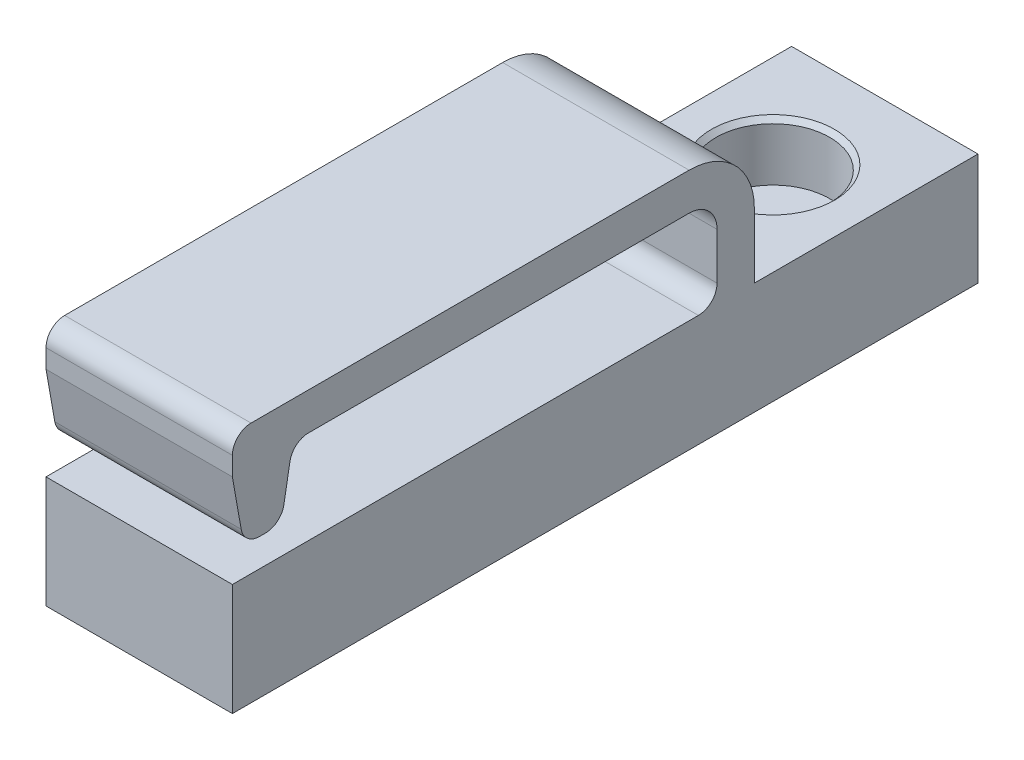
ISO-10303-21;
HEADER;
FILE_DESCRIPTION(('STEP AP214'),'2;1');
FILE_NAME('part.step','',(''),(''),'','','');
FILE_SCHEMA(('AUTOMOTIVE_DESIGN { 1 0 10303 214 1 1 1 1 }'));
ENDSEC;
DATA;
#1=APPLICATION_CONTEXT('core data for automotive mechanical design processes');
#2=APPLICATION_PROTOCOL_DEFINITION('international standard','automotive_design',2000,#1);
#3=PRODUCT_CONTEXT('',#1,'mechanical');
#4=PRODUCT('Part','Part','',(#3));
#5=PRODUCT_RELATED_PRODUCT_CATEGORY('part','',(#4));
#6=PRODUCT_DEFINITION_FORMATION('','',#4);
#7=PRODUCT_DEFINITION_CONTEXT('part definition',#1,'design');
#8=PRODUCT_DEFINITION('design','',#6,#7);
#9=PRODUCT_DEFINITION_SHAPE('','',#8);
#10=(LENGTH_UNIT() NAMED_UNIT(*) SI_UNIT(.MILLI.,.METRE.));
#11=(NAMED_UNIT(*) PLANE_ANGLE_UNIT() SI_UNIT($,.RADIAN.));
#12=(NAMED_UNIT(*) SI_UNIT($,.STERADIAN.) SOLID_ANGLE_UNIT());
#13=UNCERTAINTY_MEASURE_WITH_UNIT(LENGTH_MEASURE(1.E-05),#10,'distance_accuracy_value','');
#14=(GEOMETRIC_REPRESENTATION_CONTEXT(3) GLOBAL_UNCERTAINTY_ASSIGNED_CONTEXT((#13)) GLOBAL_UNIT_ASSIGNED_CONTEXT((#10,
#11,#12)) REPRESENTATION_CONTEXT('',''));
#15=CARTESIAN_POINT('',(0.,0.,0.));
#16=DIRECTION('',(0.,0.,1.));
#17=DIRECTION('',(1.,0.,0.));
#18=AXIS2_PLACEMENT_3D('',#15,#16,#17);
#19=CARTESIAN_POINT('',(0.,6.,0.));
#20=DIRECTION('',(0.,1.,0.));
#21=DIRECTION('',(0.,0.,1.));
#22=AXIS2_PLACEMENT_3D('',#19,#20,#21);
#23=PLANE('',#22);
#24=CARTESIAN_POINT('',(5.,6.,6.));
#25=DIRECTION('',(0.,1.,0.));
#26=DIRECTION('',(0.,0.,1.));
#27=AXIS2_PLACEMENT_3D('',#24,#25,#26);
#28=CIRCLE('',#27,3.30000000000001);
#29=CARTESIAN_POINT('',(5.,6.,9.30000000000001));
#30=VERTEX_POINT('',#29);
#31=EDGE_CURVE('E306',#30,#30,#28,.F.);
#32=ORIENTED_EDGE('',*,*,#31,.T.);
#33=EDGE_LOOP('',(#32));
#34=FACE_BOUND('',#33,.T.);
#35=DIRECTION('',(0.,0.,1.));
#36=VECTOR('',#35,1.);
#37=CARTESIAN_POINT('',(0.,6.,0.));
#38=LINE('',#37,#36);
#39=CARTESIAN_POINT('',(0.,6.,0.));
#40=VERTEX_POINT('',#39);
#41=CARTESIAN_POINT('',(0.,6.,12.));
#42=VERTEX_POINT('',#41);
#43=EDGE_CURVE('E258',#40,#42,#38,.T.);
#44=ORIENTED_EDGE('',*,*,#43,.T.);
#45=DIRECTION('',(1.,0.,0.));
#46=VECTOR('',#45,1.);
#47=CARTESIAN_POINT('',(0.,6.,12.));
#48=LINE('',#47,#46);
#49=CARTESIAN_POINT('',(10.,6.,12.));
#50=VERTEX_POINT('',#49);
#51=EDGE_CURVE('E208',#42,#50,#48,.T.);
#52=ORIENTED_EDGE('',*,*,#51,.T.);
#53=DIRECTION('',(0.,0.,-1.));
#54=VECTOR('',#53,1.);
#55=CARTESIAN_POINT('',(10.,6.,0.));
#56=LINE('',#55,#54);
#57=CARTESIAN_POINT('',(10.,6.,0.));
#58=VERTEX_POINT('',#57);
#59=EDGE_CURVE('E266',#50,#58,#56,.T.);
#60=ORIENTED_EDGE('',*,*,#59,.T.);
#61=DIRECTION('',(-1.,0.,0.));
#62=VECTOR('',#61,1.);
#63=CARTESIAN_POINT('',(0.,6.,0.));
#64=LINE('',#63,#62);
#65=EDGE_CURVE('E271',#58,#40,#64,.T.);
#66=ORIENTED_EDGE('',*,*,#65,.T.);
#67=EDGE_LOOP('',(#44,#52,#60,#66));
#68=FACE_BOUND('',#67,.T.);
#69=ADVANCED_FACE('F49',(#34,#68),#23,.T.);
#70=CARTESIAN_POINT('',(0.,6.,0.));
#71=DIRECTION('',(1.,0.,0.));
#72=DIRECTION('',(0.,0.,-1.));
#73=AXIS2_PLACEMENT_3D('',#70,#71,#72);
#74=PLANE('',#73);
#75=DIRECTION('',(0.,1.,0.));
#76=VECTOR('',#75,1.);
#77=CARTESIAN_POINT('',(0.,13.,40.));
#78=LINE('',#77,#76);
#79=CARTESIAN_POINT('',(0.,11.,40.));
#80=VERTEX_POINT('',#79);
#81=CARTESIAN_POINT('',(0.,12.,40.));
#82=VERTEX_POINT('',#81);
#83=EDGE_CURVE('E190',#80,#82,#78,.T.);
#84=ORIENTED_EDGE('',*,*,#83,.T.);
#85=CARTESIAN_POINT('',(0.,12.,39.));
#86=DIRECTION('',(1.,0.,0.));
#87=DIRECTION('',(0.,0.,-1.));
#88=AXIS2_PLACEMENT_3D('',#85,#86,#87);
#89=CIRCLE('',#88,1.);
#90=CARTESIAN_POINT('',(0.,13.,39.));
#91=VERTEX_POINT('',#90);
#92=EDGE_CURVE('E373',#82,#91,#89,.F.);
#93=ORIENTED_EDGE('',*,*,#92,.T.);
#94=DIRECTION('',(0.,0.,-1.));
#95=VECTOR('',#94,1.);
#96=CARTESIAN_POINT('',(0.,13.,12.));
#97=LINE('',#96,#95);
#98=CARTESIAN_POINT('',(0.,13.,15.5));
#99=VERTEX_POINT('',#98);
#100=EDGE_CURVE('E214',#91,#99,#97,.T.);
#101=ORIENTED_EDGE('',*,*,#100,.T.);
#102=CARTESIAN_POINT('',(0.,9.5,15.5));
#103=DIRECTION('',(1.,0.,0.));
#104=DIRECTION('',(0.,0.,-1.));
#105=AXIS2_PLACEMENT_3D('',#102,#103,#104);
#106=CIRCLE('',#105,3.5);
#107=CARTESIAN_POINT('',(0.,9.5,12.));
#108=VERTEX_POINT('',#107);
#109=EDGE_CURVE('E337',#99,#108,#106,.F.);
#110=ORIENTED_EDGE('',*,*,#109,.T.);
#111=DIRECTION('',(0.,-1.,0.));
#112=VECTOR('',#111,1.);
#113=CARTESIAN_POINT('',(0.,6.,12.));
#114=LINE('',#113,#112);
#115=EDGE_CURVE('E219',#108,#42,#114,.T.);
#116=ORIENTED_EDGE('',*,*,#115,.T.);
#117=ORIENTED_EDGE('',*,*,#43,.F.);
#118=DIRECTION('',(0.,-1.,0.));
#119=VECTOR('',#118,1.);
#120=CARTESIAN_POINT('',(0.,6.,0.));
#121=LINE('',#120,#119);
#122=CARTESIAN_POINT('',(0.,0.,0.));
#123=VERTEX_POINT('',#122);
#124=EDGE_CURVE('E274',#40,#123,#121,.T.);
#125=ORIENTED_EDGE('',*,*,#124,.T.);
#126=DIRECTION('',(0.,0.,1.));
#127=VECTOR('',#126,1.);
#128=CARTESIAN_POINT('',(0.,0.,0.));
#129=LINE('',#128,#127);
#130=CARTESIAN_POINT('',(0.,0.,40.));
#131=VERTEX_POINT('',#130);
#132=EDGE_CURVE('E257',#123,#131,#129,.T.);
#133=ORIENTED_EDGE('',*,*,#132,.T.);
#134=DIRECTION('',(0.,-1.,0.));
#135=VECTOR('',#134,1.);
#136=CARTESIAN_POINT('',(0.,6.,40.));
#137=LINE('',#136,#135);
#138=CARTESIAN_POINT('',(0.,6.,40.));
#139=VERTEX_POINT('',#138);
#140=EDGE_CURVE('E298',#139,#131,#137,.T.);
#141=ORIENTED_EDGE('',*,*,#140,.F.);
#142=CARTESIAN_POINT('',(0.,6.,15.));
#143=VERTEX_POINT('',#142);
#144=EDGE_CURVE('E263',#143,#139,#38,.T.);
#145=ORIENTED_EDGE('',*,*,#144,.F.);
#146=CARTESIAN_POINT('',(0.,7.,15.));
#147=DIRECTION('',(1.,0.,0.));
#148=DIRECTION('',(0.,0.,-1.));
#149=AXIS2_PLACEMENT_3D('',#146,#147,#148);
#150=CIRCLE('',#149,1.);
#151=CARTESIAN_POINT('',(0.,7.,14.));
#152=VERTEX_POINT('',#151);
#153=EDGE_CURVE('E350',#143,#152,#150,.T.);
#154=ORIENTED_EDGE('',*,*,#153,.T.);
#155=DIRECTION('',(0.,1.,0.));
#156=VECTOR('',#155,1.);
#157=CARTESIAN_POINT('',(0.,11.,14.));
#158=LINE('',#157,#156);
#159=CARTESIAN_POINT('',(0.,9.5,14.));
#160=VERTEX_POINT('',#159);
#161=EDGE_CURVE('E250',#152,#160,#158,.T.);
#162=ORIENTED_EDGE('',*,*,#161,.T.);
#163=CARTESIAN_POINT('',(0.,9.5,15.5));
#164=DIRECTION('',(1.,0.,0.));
#165=DIRECTION('',(0.,0.,-1.));
#166=AXIS2_PLACEMENT_3D('',#163,#164,#165);
#167=CIRCLE('',#166,1.5);
#168=CARTESIAN_POINT('',(0.,11.,15.5));
#169=VERTEX_POINT('',#168);
#170=EDGE_CURVE('E322',#160,#169,#167,.T.);
#171=ORIENTED_EDGE('',*,*,#170,.T.);
#172=DIRECTION('',(0.,0.,1.));
#173=VECTOR('',#172,1.);
#174=CARTESIAN_POINT('',(0.,11.,36.7657111350408));
#175=LINE('',#174,#173);
#176=CARTESIAN_POINT('',(0.,11.,35.9266115038635));
#177=VERTEX_POINT('',#176);
#178=EDGE_CURVE('E416',#169,#177,#175,.T.);
#179=ORIENTED_EDGE('',*,*,#178,.T.);
#180=CARTESIAN_POINT('',(0.,9.99999999999999,35.9266115038635));
#181=DIRECTION('',(1.,0.,0.));
#182=DIRECTION('',(0.,0.,-1.));
#183=AXIS2_PLACEMENT_3D('',#180,#181,#182);
#184=CIRCLE('',#183,1.);
#185=CARTESIAN_POINT('',(0.,10.1736481776669,36.9114192568757));
#186=VERTEX_POINT('',#185);
#187=EDGE_CURVE('E11',#177,#186,#184,.T.);
#188=ORIENTED_EDGE('',*,*,#187,.T.);
#189=DIRECTION('',(0.,-0.984807753012209,0.173648177666927));
#190=VECTOR('',#189,1.);
#191=CARTESIAN_POINT('',(0.,7.5,37.3828555675204));
#192=LINE('',#191,#190);
#193=CARTESIAN_POINT('',(0.,8.32635182233307,37.2371474456855));
#194=VERTEX_POINT('',#193);
#195=EDGE_CURVE('E414',#186,#194,#192,.T.);
#196=ORIENTED_EDGE('',*,*,#195,.T.);
#197=CARTESIAN_POINT('',(0.,8.5,38.2219551986977));
#198=DIRECTION('',(1.,0.,0.));
#199=DIRECTION('',(0.,0.,-1.));
#200=AXIS2_PLACEMENT_3D('',#197,#198,#199);
#201=CIRCLE('',#200,1.);
#202=CARTESIAN_POINT('',(0.,7.5,38.2219551986977));
#203=VERTEX_POINT('',#202);
#204=EDGE_CURVE('E370',#194,#203,#201,.F.);
#205=ORIENTED_EDGE('',*,*,#204,.T.);
#206=DIRECTION('',(0.,0.,1.));
#207=VECTOR('',#206,1.);
#208=CARTESIAN_POINT('',(0.,7.5,39.3828555675204));
#209=LINE('',#208,#207);
#210=CARTESIAN_POINT('',(0.,7.5,38.5437559363431));
#211=VERTEX_POINT('',#210);
#212=EDGE_CURVE('E196',#203,#211,#209,.T.);
#213=ORIENTED_EDGE('',*,*,#212,.T.);
#214=CARTESIAN_POINT('',(0.,8.5,38.5437559363431));
#215=DIRECTION('',(1.,0.,0.));
#216=DIRECTION('',(0.,0.,-1.));
#217=AXIS2_PLACEMENT_3D('',#214,#215,#216);
#218=CIRCLE('',#217,1.);
#219=CARTESIAN_POINT('',(0.,8.32635182233307,39.5285636893553));
#220=VERTEX_POINT('',#219);
#221=EDGE_CURVE('E65',#211,#220,#218,.F.);
#222=ORIENTED_EDGE('',*,*,#221,.T.);
#223=DIRECTION('',(0.,0.984807753012209,0.173648177666927));
#224=VECTOR('',#223,1.);
#225=CARTESIAN_POINT('',(0.,11.,40.));
#226=LINE('',#225,#224);
#227=EDGE_CURVE('E186',#220,#80,#226,.T.);
#228=ORIENTED_EDGE('',*,*,#227,.T.);
#229=EDGE_LOOP('',(#84,#93,#101,#110,#116,#117,#125,#133,#141,#145,#154,#162,#171,#179,#188,
#196,#205,#213,#222,#228));
#230=FACE_BOUND('',#229,.T.);
#231=ADVANCED_FACE('F188',(#230),#74,.F.);
#232=CARTESIAN_POINT('',(0.,6.,40.));
#233=DIRECTION('',(0.,0.,-1.));
#234=DIRECTION('',(-1.,0.,0.));
#235=AXIS2_PLACEMENT_3D('',#232,#233,#234);
#236=PLANE('',#235);
#237=DIRECTION('',(1.,0.,0.));
#238=VECTOR('',#237,1.);
#239=CARTESIAN_POINT('',(0.,0.,40.));
#240=LINE('',#239,#238);
#241=CARTESIAN_POINT('',(10.,0.,40.));
#242=VERTEX_POINT('',#241);
#243=EDGE_CURVE('E278',#131,#242,#240,.T.);
#244=ORIENTED_EDGE('',*,*,#243,.T.);
#245=DIRECTION('',(0.,-1.,0.));
#246=VECTOR('',#245,1.);
#247=CARTESIAN_POINT('',(10.,6.,40.));
#248=LINE('',#247,#246);
#249=CARTESIAN_POINT('',(10.,6.,40.));
#250=VERTEX_POINT('',#249);
#251=EDGE_CURVE('E294',#250,#242,#248,.T.);
#252=ORIENTED_EDGE('',*,*,#251,.F.);
#253=DIRECTION('',(1.,0.,0.));
#254=VECTOR('',#253,1.);
#255=CARTESIAN_POINT('',(0.,6.,40.));
#256=LINE('',#255,#254);
#257=EDGE_CURVE('E262',#139,#250,#256,.T.);
#258=ORIENTED_EDGE('',*,*,#257,.F.);
#259=ORIENTED_EDGE('',*,*,#140,.T.);
#260=EDGE_LOOP('',(#244,#252,#258,#259));
#261=FACE_BOUND('',#260,.T.);
#262=ADVANCED_FACE('F466',(#261),#236,.F.);
#263=CARTESIAN_POINT('',(10.,6.,0.));
#264=DIRECTION('',(-1.,0.,0.));
#265=DIRECTION('',(0.,0.,1.));
#266=AXIS2_PLACEMENT_3D('',#263,#264,#265);
#267=PLANE('',#266);
#268=DIRECTION('',(0.,0.,-1.));
#269=VECTOR('',#268,1.);
#270=CARTESIAN_POINT('',(10.,13.,12.));
#271=LINE('',#270,#269);
#272=CARTESIAN_POINT('',(10.,13.,39.));
#273=VERTEX_POINT('',#272);
#274=CARTESIAN_POINT('',(10.,13.,15.5));
#275=VERTEX_POINT('',#274);
#276=EDGE_CURVE('E244',#273,#275,#271,.T.);
#277=ORIENTED_EDGE('',*,*,#276,.F.);
#278=CARTESIAN_POINT('',(10.,12.,39.));
#279=DIRECTION('',(-1.,0.,0.));
#280=DIRECTION('',(0.,0.,1.));
#281=AXIS2_PLACEMENT_3D('',#278,#279,#280);
#282=CIRCLE('',#281,1.);
#283=CARTESIAN_POINT('',(10.,12.,40.));
#284=VERTEX_POINT('',#283);
#285=EDGE_CURVE('E363',#273,#284,#282,.F.);
#286=ORIENTED_EDGE('',*,*,#285,.T.);
#287=DIRECTION('',(0.,1.,0.));
#288=VECTOR('',#287,1.);
#289=CARTESIAN_POINT('',(10.,13.,40.));
#290=LINE('',#289,#288);
#291=CARTESIAN_POINT('',(10.,11.,40.));
#292=VERTEX_POINT('',#291);
#293=EDGE_CURVE('E241',#292,#284,#290,.T.);
#294=ORIENTED_EDGE('',*,*,#293,.F.);
#295=DIRECTION('',(0.,0.984807753012209,0.173648177666927));
#296=VECTOR('',#295,1.);
#297=CARTESIAN_POINT('',(10.,11.,40.));
#298=LINE('',#297,#296);
#299=CARTESIAN_POINT('',(10.,8.32635182233307,39.5285636893553));
#300=VERTEX_POINT('',#299);
#301=EDGE_CURVE('E202',#300,#292,#298,.T.);
#302=ORIENTED_EDGE('',*,*,#301,.F.);
#303=CARTESIAN_POINT('',(10.,8.5,38.5437559363431));
#304=DIRECTION('',(-1.,0.,0.));
#305=DIRECTION('',(0.,0.,1.));
#306=AXIS2_PLACEMENT_3D('',#303,#304,#305);
#307=CIRCLE('',#306,1.);
#308=CARTESIAN_POINT('',(10.,7.5,38.5437559363431));
#309=VERTEX_POINT('',#308);
#310=EDGE_CURVE('E357',#300,#309,#307,.F.);
#311=ORIENTED_EDGE('',*,*,#310,.T.);
#312=DIRECTION('',(0.,0.,1.));
#313=VECTOR('',#312,1.);
#314=CARTESIAN_POINT('',(10.,7.5,39.3828555675204));
#315=LINE('',#314,#313);
#316=CARTESIAN_POINT('',(10.,7.5,38.2219551986977));
#317=VERTEX_POINT('',#316);
#318=EDGE_CURVE('E236',#317,#309,#315,.T.);
#319=ORIENTED_EDGE('',*,*,#318,.F.);
#320=CARTESIAN_POINT('',(10.,8.5,38.2219551986977));
#321=DIRECTION('',(-1.,0.,0.));
#322=DIRECTION('',(0.,0.,1.));
#323=AXIS2_PLACEMENT_3D('',#320,#321,#322);
#324=CIRCLE('',#323,1.);
#325=CARTESIAN_POINT('',(10.,8.32635182233307,37.2371474456855));
#326=VERTEX_POINT('',#325);
#327=EDGE_CURVE('E360',#317,#326,#324,.F.);
#328=ORIENTED_EDGE('',*,*,#327,.T.);
#329=DIRECTION('',(0.,-0.984807753012209,0.173648177666927));
#330=VECTOR('',#329,1.);
#331=CARTESIAN_POINT('',(10.,7.5,37.3828555675204));
#332=LINE('',#331,#330);
#333=CARTESIAN_POINT('',(10.,10.1736481776669,36.9114192568757));
#334=VERTEX_POINT('',#333);
#335=EDGE_CURVE('E232',#334,#326,#332,.T.);
#336=ORIENTED_EDGE('',*,*,#335,.F.);
#337=CARTESIAN_POINT('',(10.,9.99999999999999,35.9266115038635));
#338=DIRECTION('',(-1.,0.,0.));
#339=DIRECTION('',(0.,0.,1.));
#340=AXIS2_PLACEMENT_3D('',#337,#338,#339);
#341=CIRCLE('',#340,1.);
#342=CARTESIAN_POINT('',(10.,11.,35.9266115038635));
#343=VERTEX_POINT('',#342);
#344=EDGE_CURVE('E58',#334,#343,#341,.T.);
#345=ORIENTED_EDGE('',*,*,#344,.T.);
#346=DIRECTION('',(0.,0.,1.));
#347=VECTOR('',#346,1.);
#348=CARTESIAN_POINT('',(10.,11.,36.7657111350408));
#349=LINE('',#348,#347);
#350=CARTESIAN_POINT('',(10.,11.,15.5));
#351=VERTEX_POINT('',#350);
#352=EDGE_CURVE('E228',#351,#343,#349,.T.);
#353=ORIENTED_EDGE('',*,*,#352,.F.);
#354=CARTESIAN_POINT('',(10.,9.5,15.5));
#355=DIRECTION('',(-1.,0.,0.));
#356=DIRECTION('',(0.,0.,1.));
#357=AXIS2_PLACEMENT_3D('',#354,#355,#356);
#358=CIRCLE('',#357,1.5);
#359=CARTESIAN_POINT('',(10.,9.5,14.));
#360=VERTEX_POINT('',#359);
#361=EDGE_CURVE('E318',#351,#360,#358,.T.);
#362=ORIENTED_EDGE('',*,*,#361,.T.);
#363=DIRECTION('',(0.,1.,0.));
#364=VECTOR('',#363,1.);
#365=CARTESIAN_POINT('',(10.,11.,14.));
#366=LINE('',#365,#364);
#367=CARTESIAN_POINT('',(10.,7.,14.));
#368=VERTEX_POINT('',#367);
#369=EDGE_CURVE('E225',#368,#360,#366,.T.);
#370=ORIENTED_EDGE('',*,*,#369,.F.);
#371=CARTESIAN_POINT('',(10.,7.,15.));
#372=DIRECTION('',(-1.,0.,0.));
#373=DIRECTION('',(0.,0.,1.));
#374=AXIS2_PLACEMENT_3D('',#371,#372,#373);
#375=CIRCLE('',#374,1.);
#376=CARTESIAN_POINT('',(10.,6.,15.));
#377=VERTEX_POINT('',#376);
#378=EDGE_CURVE('E347',#368,#377,#375,.T.);
#379=ORIENTED_EDGE('',*,*,#378,.T.);
#380=EDGE_CURVE('E267',#250,#377,#56,.T.);
#381=ORIENTED_EDGE('',*,*,#380,.F.);
#382=ORIENTED_EDGE('',*,*,#251,.T.);
#383=DIRECTION('',(0.,0.,-1.));
#384=VECTOR('',#383,1.);
#385=CARTESIAN_POINT('',(10.,0.,0.));
#386=LINE('',#385,#384);
#387=CARTESIAN_POINT('',(10.,0.,0.));
#388=VERTEX_POINT('',#387);
#389=EDGE_CURVE('E281',#242,#388,#386,.T.);
#390=ORIENTED_EDGE('',*,*,#389,.T.);
#391=DIRECTION('',(0.,-1.,0.));
#392=VECTOR('',#391,1.);
#393=CARTESIAN_POINT('',(10.,6.,0.));
#394=LINE('',#393,#392);
#395=EDGE_CURVE('E290',#58,#388,#394,.T.);
#396=ORIENTED_EDGE('',*,*,#395,.F.);
#397=ORIENTED_EDGE('',*,*,#59,.F.);
#398=DIRECTION('',(0.,-1.,0.));
#399=VECTOR('',#398,1.);
#400=CARTESIAN_POINT('',(10.,6.,12.));
#401=LINE('',#400,#399);
#402=CARTESIAN_POINT('',(10.,9.5,12.));
#403=VERTEX_POINT('',#402);
#404=EDGE_CURVE('E247',#403,#50,#401,.T.);
#405=ORIENTED_EDGE('',*,*,#404,.F.);
#406=CARTESIAN_POINT('',(10.,9.5,15.5));
#407=DIRECTION('',(-1.,0.,0.));
#408=DIRECTION('',(0.,0.,1.));
#409=AXIS2_PLACEMENT_3D('',#406,#407,#408);
#410=CIRCLE('',#409,3.5);
#411=EDGE_CURVE('E329',#403,#275,#410,.F.);
#412=ORIENTED_EDGE('',*,*,#411,.T.);
#413=EDGE_LOOP('',(#277,#286,#294,#302,#311,#319,#328,#336,#345,#353,#362,#370,#379,#381,#382,
#390,#396,#397,#405,#412));
#414=FACE_BOUND('',#413,.T.);
#415=ADVANCED_FACE('F401',(#414),#267,.F.);
#416=CARTESIAN_POINT('',(0.,6.,0.));
#417=DIRECTION('',(0.,0.,1.));
#418=DIRECTION('',(1.,0.,0.));
#419=AXIS2_PLACEMENT_3D('',#416,#417,#418);
#420=PLANE('',#419);
#421=DIRECTION('',(-1.,0.,0.));
#422=VECTOR('',#421,1.);
#423=CARTESIAN_POINT('',(0.,0.,0.));
#424=LINE('',#423,#422);
#425=EDGE_CURVE('E284',#388,#123,#424,.T.);
#426=ORIENTED_EDGE('',*,*,#425,.T.);
#427=ORIENTED_EDGE('',*,*,#124,.F.);
#428=ORIENTED_EDGE('',*,*,#65,.F.);
#429=ORIENTED_EDGE('',*,*,#395,.T.);
#430=EDGE_LOOP('',(#426,#427,#428,#429));
#431=FACE_BOUND('',#430,.T.);
#432=ADVANCED_FACE('F473',(#431),#420,.F.);
#433=ORIENTED_EDGE('',*,*,#380,.T.);
#434=DIRECTION('',(1.,0.,0.));
#435=VECTOR('',#434,1.);
#436=CARTESIAN_POINT('',(0.,6.,15.));
#437=LINE('',#436,#435);
#438=EDGE_CURVE('E344',#377,#143,#437,.F.);
#439=ORIENTED_EDGE('',*,*,#438,.T.);
#440=ORIENTED_EDGE('',*,*,#144,.T.);
#441=ORIENTED_EDGE('',*,*,#257,.T.);
#442=EDGE_LOOP('',(#433,#439,#440,#441));
#443=FACE_BOUND('',#442,.T.);
#444=ADVANCED_FACE('F446',(#443),#23,.T.);
#445=CARTESIAN_POINT('',(0.,0.,0.));
#446=DIRECTION('',(0.,1.,0.));
#447=DIRECTION('',(0.,0.,1.));
#448=AXIS2_PLACEMENT_3D('',#445,#446,#447);
#449=PLANE('',#448);
#450=ORIENTED_EDGE('',*,*,#132,.F.);
#451=ORIENTED_EDGE('',*,*,#425,.F.);
#452=ORIENTED_EDGE('',*,*,#389,.F.);
#453=ORIENTED_EDGE('',*,*,#243,.F.);
#454=EDGE_LOOP('',(#450,#451,#452,#453));
#455=FACE_BOUND('',#454,.T.);
#456=ADVANCED_FACE('F472',(#455),#449,.F.);
#457=CARTESIAN_POINT('',(5.,2.9,6.));
#458=DIRECTION('',(0.,1.,0.));
#459=DIRECTION('',(0.,0.,1.));
#460=AXIS2_PLACEMENT_3D('',#457,#458,#459);
#461=CYLINDRICAL_SURFACE('',#460,3.05);
#462=CARTESIAN_POINT('',(5.,5.74999999999999,6.));
#463=DIRECTION('',(0.,1.,0.));
#464=DIRECTION('',(0.,0.,1.));
#465=AXIS2_PLACEMENT_3D('',#462,#463,#464);
#466=CIRCLE('',#465,3.05);
#467=CARTESIAN_POINT('',(5.,5.74999999999999,9.05));
#468=VERTEX_POINT('',#467);
#469=EDGE_CURVE('E302',#468,#468,#466,.T.);
#470=ORIENTED_EDGE('',*,*,#469,.T.);
#471=EDGE_LOOP('',(#470));
#472=FACE_BOUND('',#471,.T.);
#473=CARTESIAN_POINT('',(5.,2.9,6.));
#474=DIRECTION('',(0.,1.,0.));
#475=DIRECTION('',(0.,0.,1.));
#476=AXIS2_PLACEMENT_3D('',#473,#474,#475);
#477=CIRCLE('',#476,3.05);
#478=CARTESIAN_POINT('',(5.,2.9,9.05));
#479=VERTEX_POINT('',#478);
#480=EDGE_CURVE('E207',#479,#479,#477,.T.);
#481=ORIENTED_EDGE('',*,*,#480,.F.);
#482=EDGE_LOOP('',(#481));
#483=FACE_BOUND('',#482,.T.);
#484=ADVANCED_FACE('F477',(#472,#483),#461,.F.);
#485=CARTESIAN_POINT('',(5.,2.9,6.));
#486=DIRECTION('',(0.,1.,0.));
#487=DIRECTION('',(0.,0.,1.));
#488=AXIS2_PLACEMENT_3D('',#485,#486,#487);
#489=PLANE('',#488);
#490=ORIENTED_EDGE('',*,*,#480,.T.);
#491=EDGE_LOOP('',(#490));
#492=FACE_BOUND('',#491,.T.);
#493=ADVANCED_FACE('F494',(#492),#489,.T.);
#494=CARTESIAN_POINT('',(5.,5.74999999999999,6.));
#495=DIRECTION('',(0.,1.,0.));
#496=DIRECTION('',(0.,0.,1.));
#497=AXIS2_PLACEMENT_3D('',#494,#495,#496);
#498=CONICAL_SURFACE('',#497,3.05,0.785398163397448);
#499=ORIENTED_EDGE('',*,*,#31,.F.);
#500=EDGE_LOOP('',(#499));
#501=FACE_BOUND('',#500,.T.);
#502=ORIENTED_EDGE('',*,*,#469,.F.);
#503=EDGE_LOOP('',(#502));
#504=FACE_BOUND('',#503,.T.);
#505=ADVANCED_FACE('F489',(#501,#504),#498,.F.);
#506=CARTESIAN_POINT('',(0.,11.,14.));
#507=DIRECTION('',(0.,0.,-1.));
#508=DIRECTION('',(-1.,0.,0.));
#509=AXIS2_PLACEMENT_3D('',#506,#507,#508);
#510=PLANE('',#509);
#511=ORIENTED_EDGE('',*,*,#161,.F.);
#512=DIRECTION('',(1.,0.,0.));
#513=VECTOR('',#512,1.);
#514=CARTESIAN_POINT('',(0.,7.,14.));
#515=LINE('',#514,#513);
#516=EDGE_CURVE('E340',#152,#368,#515,.T.);
#517=ORIENTED_EDGE('',*,*,#516,.T.);
#518=ORIENTED_EDGE('',*,*,#369,.T.);
#519=DIRECTION('',(1.,0.,0.));
#520=VECTOR('',#519,1.);
#521=CARTESIAN_POINT('',(0.,9.5,14.));
#522=LINE('',#521,#520);
#523=EDGE_CURVE('E314',#360,#160,#522,.F.);
#524=ORIENTED_EDGE('',*,*,#523,.T.);
#525=EDGE_LOOP('',(#511,#517,#518,#524));
#526=FACE_BOUND('',#525,.T.);
#527=ADVANCED_FACE('F438',(#526),#510,.F.);
#528=CARTESIAN_POINT('',(0.,11.,36.7657111350408));
#529=DIRECTION('',(0.,1.,0.));
#530=DIRECTION('',(0.,0.,1.));
#531=AXIS2_PLACEMENT_3D('',#528,#529,#530);
#532=PLANE('',#531);
#533=ORIENTED_EDGE('',*,*,#352,.T.);
#534=DIRECTION('',(1.,0.,0.));
#535=VECTOR('',#534,1.);
#536=CARTESIAN_POINT('',(0.,11.,35.9266115038635));
#537=LINE('',#536,#535);
#538=EDGE_CURVE('E383',#343,#177,#537,.F.);
#539=ORIENTED_EDGE('',*,*,#538,.T.);
#540=ORIENTED_EDGE('',*,*,#178,.F.);
#541=DIRECTION('',(1.,0.,0.));
#542=VECTOR('',#541,1.);
#543=CARTESIAN_POINT('',(10.,11.,15.5));
#544=LINE('',#543,#542);
#545=EDGE_CURVE('E310',#169,#351,#544,.T.);
#546=ORIENTED_EDGE('',*,*,#545,.T.);
#547=EDGE_LOOP('',(#533,#539,#540,#546));
#548=FACE_BOUND('',#547,.T.);
#549=ADVANCED_FACE('F406',(#548),#532,.F.);
#550=CARTESIAN_POINT('',(0.,7.5,37.3828555675204));
#551=DIRECTION('',(0.,0.173648177666927,0.984807753012209));
#552=DIRECTION('',(0.,-0.984807753012209,0.173648177666927));
#553=AXIS2_PLACEMENT_3D('',#550,#551,#552);
#554=PLANE('',#553);
#555=ORIENTED_EDGE('',*,*,#195,.F.);
#556=DIRECTION('',(1.,0.,0.));
#557=VECTOR('',#556,1.);
#558=CARTESIAN_POINT('',(10.,10.1736481776669,36.9114192568757));
#559=LINE('',#558,#557);
#560=EDGE_CURVE('E379',#186,#334,#559,.T.);
#561=ORIENTED_EDGE('',*,*,#560,.T.);
#562=ORIENTED_EDGE('',*,*,#335,.T.);
#563=DIRECTION('',(1.,0.,0.));
#564=VECTOR('',#563,1.);
#565=CARTESIAN_POINT('',(0.,8.32635182233307,37.2371474456855));
#566=LINE('',#565,#564);
#567=EDGE_CURVE('E376',#326,#194,#566,.F.);
#568=ORIENTED_EDGE('',*,*,#567,.T.);
#569=EDGE_LOOP('',(#555,#561,#562,#568));
#570=FACE_BOUND('',#569,.T.);
#571=ADVANCED_FACE('F418',(#570),#554,.F.);
#572=CARTESIAN_POINT('',(0.,7.5,39.3828555675204));
#573=DIRECTION('',(0.,1.,0.));
#574=DIRECTION('',(0.,0.,1.));
#575=AXIS2_PLACEMENT_3D('',#572,#573,#574);
#576=PLANE('',#575);
#577=ORIENTED_EDGE('',*,*,#212,.F.);
#578=DIRECTION('',(1.,0.,0.));
#579=VECTOR('',#578,1.);
#580=CARTESIAN_POINT('',(0.,7.5,38.2219551986977));
#581=LINE('',#580,#579);
#582=EDGE_CURVE('E388',#203,#317,#581,.T.);
#583=ORIENTED_EDGE('',*,*,#582,.T.);
#584=ORIENTED_EDGE('',*,*,#318,.T.);
#585=DIRECTION('',(1.,0.,0.));
#586=VECTOR('',#585,1.);
#587=CARTESIAN_POINT('',(0.,7.5,38.5437559363431));
#588=LINE('',#587,#586);
#589=EDGE_CURVE('E73',#309,#211,#588,.F.);
#590=ORIENTED_EDGE('',*,*,#589,.T.);
#591=EDGE_LOOP('',(#577,#583,#584,#590));
#592=FACE_BOUND('',#591,.T.);
#593=ADVANCED_FACE('F513',(#592),#576,.F.);
#594=CARTESIAN_POINT('',(0.,11.,40.));
#595=DIRECTION('',(0.,0.173648177666927,-0.984807753012209));
#596=DIRECTION('',(0.,0.984807753012209,0.173648177666927));
#597=AXIS2_PLACEMENT_3D('',#594,#595,#596);
#598=PLANE('',#597);
#599=ORIENTED_EDGE('',*,*,#227,.F.);
#600=DIRECTION('',(1.,0.,0.));
#601=VECTOR('',#600,1.);
#602=CARTESIAN_POINT('',(0.,8.32635182233307,39.5285636893553));
#603=LINE('',#602,#601);
#604=EDGE_CURVE('E392',#220,#300,#603,.T.);
#605=ORIENTED_EDGE('',*,*,#604,.T.);
#606=ORIENTED_EDGE('',*,*,#301,.T.);
#607=DIRECTION('',(1.,0.,0.));
#608=VECTOR('',#607,1.);
#609=CARTESIAN_POINT('',(0.,11.,40.));
#610=LINE('',#609,#608);
#611=EDGE_CURVE('E199',#80,#292,#610,.T.);
#612=ORIENTED_EDGE('',*,*,#611,.F.);
#613=EDGE_LOOP('',(#599,#605,#606,#612));
#614=FACE_BOUND('',#613,.T.);
#615=ADVANCED_FACE('F200',(#614),#598,.F.);
#616=CARTESIAN_POINT('',(0.,13.,40.));
#617=DIRECTION('',(0.,0.,-1.));
#618=DIRECTION('',(-1.,0.,0.));
#619=AXIS2_PLACEMENT_3D('',#616,#617,#618);
#620=PLANE('',#619);
#621=ORIENTED_EDGE('',*,*,#293,.T.);
#622=DIRECTION('',(1.,0.,0.));
#623=VECTOR('',#622,1.);
#624=CARTESIAN_POINT('',(0.,12.,40.));
#625=LINE('',#624,#623);
#626=EDGE_CURVE('E212',#284,#82,#625,.F.);
#627=ORIENTED_EDGE('',*,*,#626,.T.);
#628=ORIENTED_EDGE('',*,*,#83,.F.);
#629=ORIENTED_EDGE('',*,*,#611,.T.);
#630=EDGE_LOOP('',(#621,#627,#628,#629));
#631=FACE_BOUND('',#630,.T.);
#632=ADVANCED_FACE('F210',(#631),#620,.F.);
#633=CARTESIAN_POINT('',(0.,13.,12.));
#634=DIRECTION('',(0.,-1.,0.));
#635=DIRECTION('',(0.,0.,-1.));
#636=AXIS2_PLACEMENT_3D('',#633,#634,#635);
#637=PLANE('',#636);
#638=ORIENTED_EDGE('',*,*,#100,.F.);
#639=DIRECTION('',(1.,0.,0.));
#640=VECTOR('',#639,1.);
#641=CARTESIAN_POINT('',(0.,13.,39.));
#642=LINE('',#641,#640);
#643=EDGE_CURVE('E353',#91,#273,#642,.T.);
#644=ORIENTED_EDGE('',*,*,#643,.T.);
#645=ORIENTED_EDGE('',*,*,#276,.T.);
#646=DIRECTION('',(1.,0.,0.));
#647=VECTOR('',#646,1.);
#648=CARTESIAN_POINT('',(0.,13.,15.5));
#649=LINE('',#648,#647);
#650=EDGE_CURVE('E333',#275,#99,#649,.F.);
#651=ORIENTED_EDGE('',*,*,#650,.T.);
#652=EDGE_LOOP('',(#638,#644,#645,#651));
#653=FACE_BOUND('',#652,.T.);
#654=ADVANCED_FACE('F500',(#653),#637,.F.);
#655=CARTESIAN_POINT('',(0.,6.,12.));
#656=DIRECTION('',(0.,0.,1.));
#657=DIRECTION('',(1.,0.,0.));
#658=AXIS2_PLACEMENT_3D('',#655,#656,#657);
#659=PLANE('',#658);
#660=ORIENTED_EDGE('',*,*,#115,.F.);
#661=DIRECTION('',(1.,0.,0.));
#662=VECTOR('',#661,1.);
#663=CARTESIAN_POINT('',(0.,9.5,12.));
#664=LINE('',#663,#662);
#665=EDGE_CURVE('E325',#108,#403,#664,.T.);
#666=ORIENTED_EDGE('',*,*,#665,.T.);
#667=ORIENTED_EDGE('',*,*,#404,.T.);
#668=ORIENTED_EDGE('',*,*,#51,.F.);
#669=EDGE_LOOP('',(#660,#666,#667,#668));
#670=FACE_BOUND('',#669,.T.);
#671=ADVANCED_FACE('F497',(#670),#659,.F.);
#672=CARTESIAN_POINT('',(0.,9.5,15.5));
#673=DIRECTION('',(-1.,0.,0.));
#674=DIRECTION('',(0.,0.,1.));
#675=AXIS2_PLACEMENT_3D('',#672,#673,#674);
#676=CYLINDRICAL_SURFACE('',#675,1.5);
#677=ORIENTED_EDGE('',*,*,#170,.F.);
#678=ORIENTED_EDGE('',*,*,#523,.F.);
#679=ORIENTED_EDGE('',*,*,#361,.F.);
#680=ORIENTED_EDGE('',*,*,#545,.F.);
#681=EDGE_LOOP('',(#677,#678,#679,#680));
#682=FACE_BOUND('',#681,.T.);
#683=ADVANCED_FACE('F441',(#682),#676,.F.);
#684=CARTESIAN_POINT('',(0.,9.5,15.5));
#685=DIRECTION('',(1.,0.,0.));
#686=DIRECTION('',(0.,0.,-1.));
#687=AXIS2_PLACEMENT_3D('',#684,#685,#686);
#688=CYLINDRICAL_SURFACE('',#687,3.5);
#689=ORIENTED_EDGE('',*,*,#109,.F.);
#690=ORIENTED_EDGE('',*,*,#650,.F.);
#691=ORIENTED_EDGE('',*,*,#411,.F.);
#692=ORIENTED_EDGE('',*,*,#665,.F.);
#693=EDGE_LOOP('',(#689,#690,#691,#692));
#694=FACE_BOUND('',#693,.T.);
#695=ADVANCED_FACE('F452',(#694),#688,.T.);
#696=CARTESIAN_POINT('',(0.,7.,15.));
#697=DIRECTION('',(1.,0.,0.));
#698=DIRECTION('',(0.,0.,-1.));
#699=AXIS2_PLACEMENT_3D('',#696,#697,#698);
#700=CYLINDRICAL_SURFACE('',#699,1.);
#701=ORIENTED_EDGE('',*,*,#153,.F.);
#702=ORIENTED_EDGE('',*,*,#438,.F.);
#703=ORIENTED_EDGE('',*,*,#378,.F.);
#704=ORIENTED_EDGE('',*,*,#516,.F.);
#705=EDGE_LOOP('',(#701,#702,#703,#704));
#706=FACE_BOUND('',#705,.T.);
#707=ADVANCED_FACE('F449',(#706),#700,.F.);
#708=CARTESIAN_POINT('',(0.,12.,39.));
#709=DIRECTION('',(1.,0.,0.));
#710=DIRECTION('',(0.,0.,-1.));
#711=AXIS2_PLACEMENT_3D('',#708,#709,#710);
#712=CYLINDRICAL_SURFACE('',#711,1.);
#713=ORIENTED_EDGE('',*,*,#92,.F.);
#714=ORIENTED_EDGE('',*,*,#626,.F.);
#715=ORIENTED_EDGE('',*,*,#285,.F.);
#716=ORIENTED_EDGE('',*,*,#643,.F.);
#717=EDGE_LOOP('',(#713,#714,#715,#716));
#718=FACE_BOUND('',#717,.T.);
#719=ADVANCED_FACE('F451',(#718),#712,.T.);
#720=CARTESIAN_POINT('',(0.,9.99999999999999,35.9266115038635));
#721=DIRECTION('',(-1.,0.,0.));
#722=DIRECTION('',(0.,0.,1.));
#723=AXIS2_PLACEMENT_3D('',#720,#721,#722);
#724=CYLINDRICAL_SURFACE('',#723,1.);
#725=ORIENTED_EDGE('',*,*,#187,.F.);
#726=ORIENTED_EDGE('',*,*,#538,.F.);
#727=ORIENTED_EDGE('',*,*,#344,.F.);
#728=ORIENTED_EDGE('',*,*,#560,.F.);
#729=EDGE_LOOP('',(#725,#726,#727,#728));
#730=FACE_BOUND('',#729,.T.);
#731=ADVANCED_FACE('F411',(#730),#724,.F.);
#732=CARTESIAN_POINT('',(0.,8.5,38.2219551986977));
#733=DIRECTION('',(1.,0.,0.));
#734=DIRECTION('',(0.,0.,-1.));
#735=AXIS2_PLACEMENT_3D('',#732,#733,#734);
#736=CYLINDRICAL_SURFACE('',#735,1.);
#737=ORIENTED_EDGE('',*,*,#204,.F.);
#738=ORIENTED_EDGE('',*,*,#567,.F.);
#739=ORIENTED_EDGE('',*,*,#327,.F.);
#740=ORIENTED_EDGE('',*,*,#582,.F.);
#741=EDGE_LOOP('',(#737,#738,#739,#740));
#742=FACE_BOUND('',#741,.T.);
#743=ADVANCED_FACE('F578',(#742),#736,.T.);
#744=CARTESIAN_POINT('',(0.,8.5,38.5437559363431));
#745=DIRECTION('',(1.,0.,0.));
#746=DIRECTION('',(0.,0.,-1.));
#747=AXIS2_PLACEMENT_3D('',#744,#745,#746);
#748=CYLINDRICAL_SURFACE('',#747,1.);
#749=ORIENTED_EDGE('',*,*,#221,.F.);
#750=ORIENTED_EDGE('',*,*,#589,.F.);
#751=ORIENTED_EDGE('',*,*,#310,.F.);
#752=ORIENTED_EDGE('',*,*,#604,.F.);
#753=EDGE_LOOP('',(#749,#750,#751,#752));
#754=FACE_BOUND('',#753,.T.);
#755=ADVANCED_FACE('F51',(#754),#748,.T.);
#756=CLOSED_SHELL('',(#69,#231,#262,#415,#432,#444,#456,#484,#493,#505,#527,#549,#571,#593,#615,
#632,#654,#671,#683,#695,#707,#719,#731,#743,#755));
#757=MANIFOLD_SOLID_BREP('B2',#756);
#758=ADVANCED_BREP_SHAPE_REPRESENTATION('',(#18,#757),#14);
#759=SHAPE_DEFINITION_REPRESENTATION(#9,#758);
ENDSEC;
END-ISO-10303-21;
